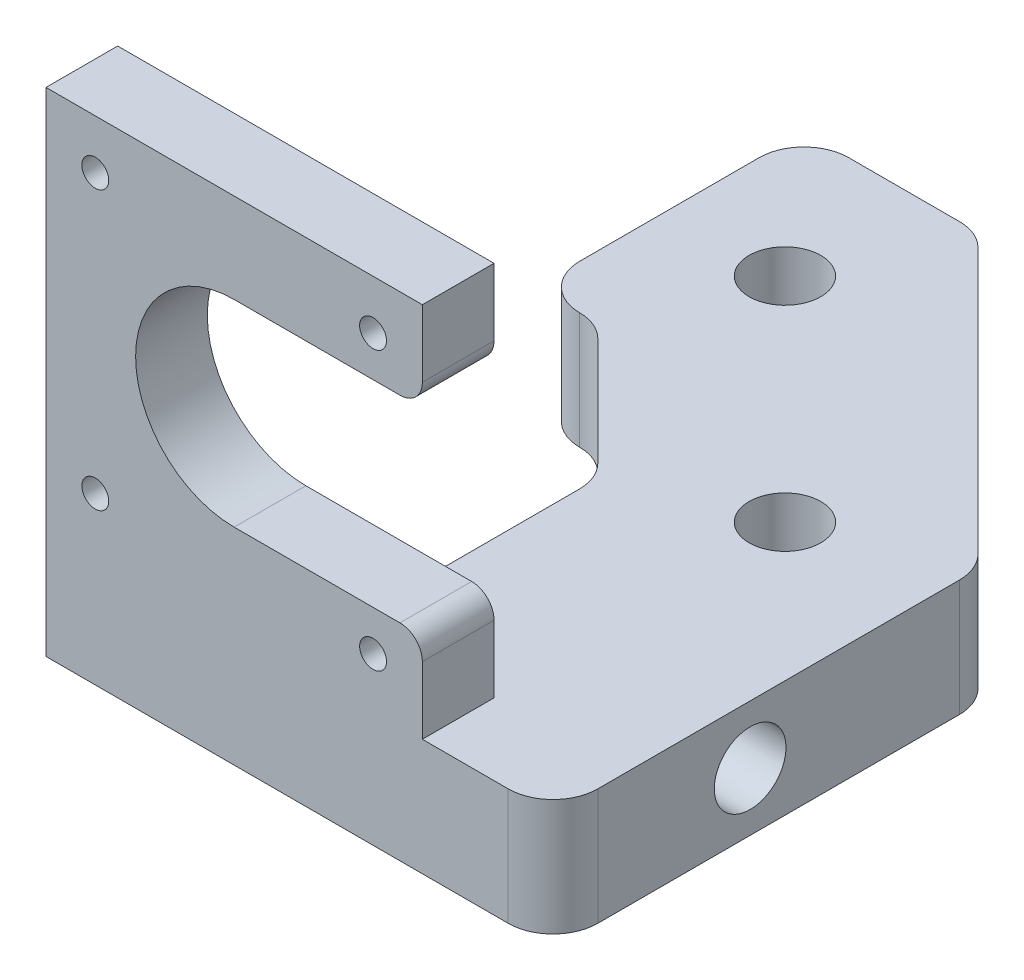
ISO-10303-21;
HEADER;
FILE_DESCRIPTION(('STEP AP214'),'2;1');
FILE_NAME('part.step','',(''),(''),'','','');
FILE_SCHEMA(('AUTOMOTIVE_DESIGN { 1 0 10303 214 1 1 1 1 }'));
ENDSEC;
DATA;
#1=APPLICATION_CONTEXT('core data for automotive mechanical design processes');
#2=APPLICATION_PROTOCOL_DEFINITION('international standard','automotive_design',2000,#1);
#3=PRODUCT_CONTEXT('',#1,'mechanical');
#4=PRODUCT('Part','Part','',(#3));
#5=PRODUCT_RELATED_PRODUCT_CATEGORY('part','',(#4));
#6=PRODUCT_DEFINITION_FORMATION('','',#4);
#7=PRODUCT_DEFINITION_CONTEXT('part definition',#1,'design');
#8=PRODUCT_DEFINITION('design','',#6,#7);
#9=PRODUCT_DEFINITION_SHAPE('','',#8);
#10=(LENGTH_UNIT() NAMED_UNIT(*) SI_UNIT(.MILLI.,.METRE.));
#11=(NAMED_UNIT(*) PLANE_ANGLE_UNIT() SI_UNIT($,.RADIAN.));
#12=(NAMED_UNIT(*) SI_UNIT($,.STERADIAN.) SOLID_ANGLE_UNIT());
#13=UNCERTAINTY_MEASURE_WITH_UNIT(LENGTH_MEASURE(1.E-05),#10,'distance_accuracy_value','');
#14=(GEOMETRIC_REPRESENTATION_CONTEXT(3) GLOBAL_UNCERTAINTY_ASSIGNED_CONTEXT((#13)) GLOBAL_UNIT_ASSIGNED_CONTEXT((#10,
#11,#12)) REPRESENTATION_CONTEXT('',''));
#15=CARTESIAN_POINT('',(0.,0.,0.));
#16=DIRECTION('',(0.,0.,1.));
#17=DIRECTION('',(1.,0.,0.));
#18=AXIS2_PLACEMENT_3D('',#15,#16,#17);
#19=CARTESIAN_POINT('',(15.75,55.,42.0000000000036));
#20=DIRECTION('',(-1.,0.,0.));
#21=DIRECTION('',(0.,0.,1.));
#22=AXIS2_PLACEMENT_3D('',#19,#20,#21);
#23=PLANE('',#22);
#24=DIRECTION('',(0.,-1.,0.));
#25=VECTOR('',#24,1.);
#26=CARTESIAN_POINT('',(15.75,55.,42.0000000000036));
#27=LINE('',#26,#25);
#28=CARTESIAN_POINT('',(15.75,20.5,42.0000000000036));
#29=VERTEX_POINT('',#28);
#30=CARTESIAN_POINT('',(15.75,13.,42.0000000000036));
#31=VERTEX_POINT('',#30);
#32=EDGE_CURVE('E256',#29,#31,#27,.T.);
#33=ORIENTED_EDGE('',*,*,#32,.F.);
#34=DIRECTION('',(0.,0.,-1.));
#35=VECTOR('',#34,1.);
#36=CARTESIAN_POINT('',(15.75,20.5,42.0000000000036));
#37=LINE('',#36,#35);
#38=CARTESIAN_POINT('',(15.75,20.5,50.0000000000032));
#39=VERTEX_POINT('',#38);
#40=EDGE_CURVE('E289',#29,#39,#37,.F.);
#41=ORIENTED_EDGE('',*,*,#40,.T.);
#42=DIRECTION('',(0.,-1.,0.));
#43=VECTOR('',#42,1.);
#44=CARTESIAN_POINT('',(15.75,55.,50.0000000000032));
#45=LINE('',#44,#43);
#46=CARTESIAN_POINT('',(15.75,13.,50.0000000000032));
#47=VERTEX_POINT('',#46);
#48=EDGE_CURVE('E260',#39,#47,#45,.T.);
#49=ORIENTED_EDGE('',*,*,#48,.T.);
#50=DIRECTION('',(0.,0.,-1.));
#51=VECTOR('',#50,1.);
#52=CARTESIAN_POINT('',(15.75,13.,42.0000000000036));
#53=LINE('',#52,#51);
#54=EDGE_CURVE('E244',#47,#31,#53,.T.);
#55=ORIENTED_EDGE('',*,*,#54,.T.);
#56=EDGE_LOOP('',(#33,#41,#49,#55));
#57=FACE_BOUND('',#56,.T.);
#58=ADVANCED_FACE('F31',(#57),#23,.F.);
#59=CARTESIAN_POINT('',(-21.6688483677535,13.,0.));
#60=DIRECTION('',(0.,-1.,0.));
#61=DIRECTION('',(0.,0.,-1.));
#62=AXIS2_PLACEMENT_3D('',#59,#60,#61);
#63=PLANE('',#62);
#64=CARTESIAN_POINT('',(14.9999999999997,13.,8.7867965644033));
#65=DIRECTION('',(0.,1.,0.));
#66=DIRECTION('',(0.,0.,1.));
#67=AXIS2_PLACEMENT_3D('',#64,#65,#66);
#68=CIRCLE('',#67,4.);
#69=CARTESIAN_POINT('',(14.9999999999997,13.,12.7867965644033));
#70=VERTEX_POINT('',#69);
#71=EDGE_CURVE('E460',#70,#70,#68,.T.);
#72=ORIENTED_EDGE('',*,*,#71,.F.);
#73=EDGE_LOOP('',(#72));
#74=FACE_BOUND('',#73,.T.);
#75=CARTESIAN_POINT('',(-8.78679656440375,13.,-15.0000000000002));
#76=DIRECTION('',(0.,1.,0.));
#77=DIRECTION('',(0.,0.,1.));
#78=AXIS2_PLACEMENT_3D('',#75,#76,#77);
#79=CIRCLE('',#78,4.);
#80=CARTESIAN_POINT('',(-8.78679656440375,13.,-11.0000000000002));
#81=VERTEX_POINT('',#80);
#82=EDGE_CURVE('E452',#81,#81,#79,.T.);
#83=ORIENTED_EDGE('',*,*,#82,.F.);
#84=EDGE_LOOP('',(#83));
#85=FACE_BOUND('',#84,.T.);
#86=DIRECTION('',(-1.,0.,0.));
#87=VECTOR('',#86,1.);
#88=CARTESIAN_POINT('',(-26.2500000000003,13.,42.0000000000036));
#89=LINE('',#88,#87);
#90=CARTESIAN_POINT('',(0.331151632246484,13.,42.0000000000036));
#91=VERTEX_POINT('',#90);
#92=EDGE_CURVE('E249',#31,#91,#89,.T.);
#93=ORIENTED_EDGE('',*,*,#92,.F.);
#94=ORIENTED_EDGE('',*,*,#54,.F.);
#95=DIRECTION('',(1.,0.,0.));
#96=VECTOR('',#95,1.);
#97=CARTESIAN_POINT('',(-26.2500000000003,13.,50.0000000000032));
#98=LINE('',#97,#96);
#99=CARTESIAN_POINT('',(25.3311516322459,13.,50.0000000000032));
#100=VERTEX_POINT('',#99);
#101=EDGE_CURVE('E269',#47,#100,#98,.T.);
#102=ORIENTED_EDGE('',*,*,#101,.T.);
#103=CARTESIAN_POINT('',(25.3311516322459,13.,45.0000000000032));
#104=DIRECTION('',(0.,-1.,0.));
#105=DIRECTION('',(0.,0.,-1.));
#106=AXIS2_PLACEMENT_3D('',#103,#104,#105);
#107=CIRCLE('',#106,5.);
#108=CARTESIAN_POINT('',(30.3311516322459,13.,45.0000000000032));
#109=VERTEX_POINT('',#108);
#110=EDGE_CURVE('E347',#100,#109,#107,.F.);
#111=ORIENTED_EDGE('',*,*,#110,.T.);
#112=DIRECTION('',(0.,0.,-1.));
#113=VECTOR('',#112,1.);
#114=CARTESIAN_POINT('',(30.3311516322459,13.,2.57359312880659));
#115=LINE('',#114,#113);
#116=CARTESIAN_POINT('',(30.3311516322459,13.,4.64466094067207));
#117=VERTEX_POINT('',#116);
#118=EDGE_CURVE('E444',#109,#117,#115,.T.);
#119=ORIENTED_EDGE('',*,*,#118,.T.);
#120=CARTESIAN_POINT('',(25.3311516322459,13.,4.64466094067207));
#121=DIRECTION('',(0.,-1.,0.));
#122=DIRECTION('',(0.,0.,-1.));
#123=AXIS2_PLACEMENT_3D('',#120,#121,#122);
#124=CIRCLE('',#123,5.);
#125=CARTESIAN_POINT('',(28.8666855381787,13.,1.10912703473934));
#126=VERTEX_POINT('',#125);
#127=EDGE_CURVE('E345',#117,#126,#124,.F.);
#128=ORIENTED_EDGE('',*,*,#127,.T.);
#129=DIRECTION('',(-0.707106781186548,0.,-0.707106781186548));
#130=VECTOR('',#129,1.);
#131=CARTESIAN_POINT('',(-2.24244149656067,13.,-30.));
#132=LINE('',#131,#130);
#133=CARTESIAN_POINT('',(-0.777975402493406,13.,-28.5355339059327));
#134=VERTEX_POINT('',#133);
#135=EDGE_CURVE('E447',#126,#134,#132,.T.);
#136=ORIENTED_EDGE('',*,*,#135,.T.);
#137=CARTESIAN_POINT('',(-4.31350930842614,13.,-25.));
#138=DIRECTION('',(0.,-1.,0.));
#139=DIRECTION('',(0.,0.,-1.));
#140=AXIS2_PLACEMENT_3D('',#137,#138,#139);
#141=CIRCLE('',#140,5.);
#142=CARTESIAN_POINT('',(-4.31350930842614,13.,-30.));
#143=VERTEX_POINT('',#142);
#144=EDGE_CURVE('E343',#134,#143,#141,.F.);
#145=ORIENTED_EDGE('',*,*,#144,.T.);
#146=DIRECTION('',(-1.,0.,0.));
#147=VECTOR('',#146,1.);
#148=CARTESIAN_POINT('',(-21.6688483677535,13.,-30.));
#149=LINE('',#148,#147);
#150=CARTESIAN_POINT('',(-16.6688483677535,13.,-30.));
#151=VERTEX_POINT('',#150);
#152=EDGE_CURVE('E323',#143,#151,#149,.T.);
#153=ORIENTED_EDGE('',*,*,#152,.T.);
#154=CARTESIAN_POINT('',(-16.6688483677535,13.,-25.));
#155=DIRECTION('',(0.,-1.,0.));
#156=DIRECTION('',(0.,0.,-1.));
#157=AXIS2_PLACEMENT_3D('',#154,#155,#156);
#158=CIRCLE('',#157,5.);
#159=CARTESIAN_POINT('',(-21.6688483677535,13.,-25.));
#160=VERTEX_POINT('',#159);
#161=EDGE_CURVE('E387',#151,#160,#158,.F.);
#162=ORIENTED_EDGE('',*,*,#161,.T.);
#163=DIRECTION('',(0.,0.,1.));
#164=VECTOR('',#163,1.);
#165=CARTESIAN_POINT('',(-21.6688483677535,13.,0.));
#166=LINE('',#165,#164);
#167=CARTESIAN_POINT('',(-21.6688483677535,13.,-4.99974746511714));
#168=VERTEX_POINT('',#167);
#169=EDGE_CURVE('E318',#160,#168,#166,.T.);
#170=ORIENTED_EDGE('',*,*,#169,.T.);
#171=CARTESIAN_POINT('',(-16.6688483677535,13.,-4.99974746511714));
#172=DIRECTION('',(0.,-1.,0.));
#173=DIRECTION('',(0.,0.,-1.));
#174=AXIS2_PLACEMENT_3D('',#171,#172,#173);
#175=CIRCLE('',#174,5.);
#176=CARTESIAN_POINT('',(-16.7043822736864,13.,0.000126267441430579));
#177=VERTEX_POINT('',#176);
#178=EDGE_CURVE('E385',#168,#177,#175,.F.);
#179=ORIENTED_EDGE('',*,*,#178,.T.);
#180=CARTESIAN_POINT('',(-16.7399161796193,13.,5.));
#181=DIRECTION('',(0.,-1.,0.));
#182=DIRECTION('',(0.,0.,-1.));
#183=AXIS2_PLACEMENT_3D('',#180,#181,#182);
#184=CIRCLE('',#183,5.);
#185=CARTESIAN_POINT('',(-13.2043822736866,13.,1.46446609406726));
#186=VERTEX_POINT('',#185);
#187=EDGE_CURVE('E372',#177,#186,#184,.T.);
#188=ORIENTED_EDGE('',*,*,#187,.T.);
#189=DIRECTION('',(0.707106781186548,0.,0.707106781186547));
#190=VECTOR('',#189,1.);
#191=CARTESIAN_POINT('',(0.331151632246484,13.,15.0000000000003));
#192=LINE('',#191,#190);
#193=CARTESIAN_POINT('',(-1.13331446182078,13.,13.5355339059331));
#194=VERTEX_POINT('',#193);
#195=EDGE_CURVE('E431',#186,#194,#192,.T.);
#196=ORIENTED_EDGE('',*,*,#195,.T.);
#197=CARTESIAN_POINT('',(-4.66884836775352,13.,17.0710678118658));
#198=DIRECTION('',(0.,-1.,0.));
#199=DIRECTION('',(0.,0.,-1.));
#200=AXIS2_PLACEMENT_3D('',#197,#198,#199);
#201=CIRCLE('',#200,5.);
#202=CARTESIAN_POINT('',(0.331151632246484,13.,17.0710678118658));
#203=VERTEX_POINT('',#202);
#204=EDGE_CURVE('E367',#194,#203,#201,.T.);
#205=ORIENTED_EDGE('',*,*,#204,.T.);
#206=DIRECTION('',(0.,0.,1.));
#207=VECTOR('',#206,1.);
#208=CARTESIAN_POINT('',(0.331151632246484,13.,42.0000000000036));
#209=LINE('',#208,#207);
#210=EDGE_CURVE('E281',#203,#91,#209,.T.);
#211=ORIENTED_EDGE('',*,*,#210,.T.);
#212=EDGE_LOOP('',(#93,#94,#102,#111,#119,#128,#136,#145,#153,#162,#170,#179,#188,#196,#205,#211));
#213=FACE_BOUND('',#212,.T.);
#214=ADVANCED_FACE('F490',(#74,#85,#213),#63,.F.);
#215=CARTESIAN_POINT('',(-21.6688483677535,0.,0.));
#216=DIRECTION('',(0.,-1.,0.));
#217=DIRECTION('',(0.,0.,-1.));
#218=AXIS2_PLACEMENT_3D('',#215,#216,#217);
#219=PLANE('',#218);
#220=CARTESIAN_POINT('',(-8.78679656440375,0.,-15.0000000000002));
#221=DIRECTION('',(0.,1.,0.));
#222=DIRECTION('',(0.,0.,1.));
#223=AXIS2_PLACEMENT_3D('',#220,#221,#222);
#224=CIRCLE('',#223,4.);
#225=CARTESIAN_POINT('',(-8.78679656440375,0.,-11.0000000000002));
#226=VERTEX_POINT('',#225);
#227=EDGE_CURVE('E440',#226,#226,#224,.T.);
#228=ORIENTED_EDGE('',*,*,#227,.T.);
#229=EDGE_LOOP('',(#228));
#230=FACE_BOUND('',#229,.T.);
#231=DIRECTION('',(0.,0.,1.));
#232=VECTOR('',#231,1.);
#233=CARTESIAN_POINT('',(-21.6688483677535,0.,0.));
#234=LINE('',#233,#232);
#235=CARTESIAN_POINT('',(-21.6688483677535,0.,-25.));
#236=VERTEX_POINT('',#235);
#237=CARTESIAN_POINT('',(-21.6688483677535,0.,-4.99974746511714));
#238=VERTEX_POINT('',#237);
#239=EDGE_CURVE('E326',#236,#238,#234,.T.);
#240=ORIENTED_EDGE('',*,*,#239,.F.);
#241=CARTESIAN_POINT('',(-16.6688483677535,0.,-25.));
#242=DIRECTION('',(0.,-1.,0.));
#243=DIRECTION('',(0.,0.,-1.));
#244=AXIS2_PLACEMENT_3D('',#241,#242,#243);
#245=CIRCLE('',#244,5.);
#246=CARTESIAN_POINT('',(-16.6688483677535,0.,-30.));
#247=VERTEX_POINT('',#246);
#248=EDGE_CURVE('E381',#236,#247,#245,.T.);
#249=ORIENTED_EDGE('',*,*,#248,.T.);
#250=DIRECTION('',(-1.,0.,0.));
#251=VECTOR('',#250,1.);
#252=CARTESIAN_POINT('',(-21.6688483677535,0.,-30.));
#253=LINE('',#252,#251);
#254=CARTESIAN_POINT('',(-4.31350930842614,0.,-30.));
#255=VERTEX_POINT('',#254);
#256=EDGE_CURVE('E425',#255,#247,#253,.T.);
#257=ORIENTED_EDGE('',*,*,#256,.F.);
#258=CARTESIAN_POINT('',(-4.31350930842614,0.,-25.));
#259=DIRECTION('',(0.,-1.,0.));
#260=DIRECTION('',(0.,0.,-1.));
#261=AXIS2_PLACEMENT_3D('',#258,#259,#260);
#262=CIRCLE('',#261,5.);
#263=CARTESIAN_POINT('',(-0.777975402493406,0.,-28.5355339059327));
#264=VERTEX_POINT('',#263);
#265=EDGE_CURVE('E334',#255,#264,#262,.T.);
#266=ORIENTED_EDGE('',*,*,#265,.T.);
#267=DIRECTION('',(-0.707106781186548,0.,-0.707106781186548));
#268=VECTOR('',#267,1.);
#269=CARTESIAN_POINT('',(-2.24244149656067,0.,-30.));
#270=LINE('',#269,#268);
#271=CARTESIAN_POINT('',(28.8666855381787,0.,1.10912703473934));
#272=VERTEX_POINT('',#271);
#273=EDGE_CURVE('E423',#272,#264,#270,.T.);
#274=ORIENTED_EDGE('',*,*,#273,.F.);
#275=CARTESIAN_POINT('',(25.3311516322459,0.,4.64466094067207));
#276=DIRECTION('',(0.,-1.,0.));
#277=DIRECTION('',(0.,0.,-1.));
#278=AXIS2_PLACEMENT_3D('',#275,#276,#277);
#279=CIRCLE('',#278,5.);
#280=CARTESIAN_POINT('',(30.3311516322459,0.,4.64466094067207));
#281=VERTEX_POINT('',#280);
#282=EDGE_CURVE('E336',#272,#281,#279,.T.);
#283=ORIENTED_EDGE('',*,*,#282,.T.);
#284=DIRECTION('',(0.,0.,-1.));
#285=VECTOR('',#284,1.);
#286=CARTESIAN_POINT('',(30.3311516322459,0.,2.57359312880659));
#287=LINE('',#286,#285);
#288=CARTESIAN_POINT('',(30.3311516322459,0.,45.0000000000032));
#289=VERTEX_POINT('',#288);
#290=EDGE_CURVE('E420',#289,#281,#287,.T.);
#291=ORIENTED_EDGE('',*,*,#290,.F.);
#292=CARTESIAN_POINT('',(25.3311516322459,0.,45.0000000000032));
#293=DIRECTION('',(0.,-1.,0.));
#294=DIRECTION('',(0.,0.,-1.));
#295=AXIS2_PLACEMENT_3D('',#292,#293,#294);
#296=CIRCLE('',#295,5.);
#297=CARTESIAN_POINT('',(25.3311516322459,0.,50.0000000000032));
#298=VERTEX_POINT('',#297);
#299=EDGE_CURVE('E338',#289,#298,#296,.T.);
#300=ORIENTED_EDGE('',*,*,#299,.T.);
#301=DIRECTION('',(1.,0.,0.));
#302=VECTOR('',#301,1.);
#303=CARTESIAN_POINT('',(-26.2500000000003,0.,50.0000000000032));
#304=LINE('',#303,#302);
#305=CARTESIAN_POINT('',(-26.2500000000003,0.,50.0000000000032));
#306=VERTEX_POINT('',#305);
#307=EDGE_CURVE('E413',#306,#298,#304,.T.);
#308=ORIENTED_EDGE('',*,*,#307,.F.);
#309=DIRECTION('',(0.,0.,1.));
#310=VECTOR('',#309,1.);
#311=CARTESIAN_POINT('',(-26.2500000000003,0.,50.0000000000032));
#312=LINE('',#311,#310);
#313=CARTESIAN_POINT('',(-26.2500000000003,0.,42.0000000000036));
#314=VERTEX_POINT('',#313);
#315=EDGE_CURVE('E315',#314,#306,#312,.T.);
#316=ORIENTED_EDGE('',*,*,#315,.F.);
#317=DIRECTION('',(-1.,0.,0.));
#318=VECTOR('',#317,1.);
#319=CARTESIAN_POINT('',(-26.2500000000003,0.,42.0000000000036));
#320=LINE('',#319,#318);
#321=CARTESIAN_POINT('',(0.331151632246484,0.,42.0000000000036));
#322=VERTEX_POINT('',#321);
#323=EDGE_CURVE('E402',#322,#314,#320,.T.);
#324=ORIENTED_EDGE('',*,*,#323,.F.);
#325=DIRECTION('',(0.,0.,1.));
#326=VECTOR('',#325,1.);
#327=CARTESIAN_POINT('',(0.331151632246484,0.,42.0000000000036));
#328=LINE('',#327,#326);
#329=CARTESIAN_POINT('',(0.331151632246484,0.,17.0710678118658));
#330=VERTEX_POINT('',#329);
#331=EDGE_CURVE('E411',#330,#322,#328,.T.);
#332=ORIENTED_EDGE('',*,*,#331,.F.);
#333=CARTESIAN_POINT('',(-4.66884836775352,0.,17.0710678118658));
#334=DIRECTION('',(0.,-1.,0.));
#335=DIRECTION('',(0.,0.,-1.));
#336=AXIS2_PLACEMENT_3D('',#333,#334,#335);
#337=CIRCLE('',#336,5.);
#338=CARTESIAN_POINT('',(-1.13331446182078,0.,13.5355339059331));
#339=VERTEX_POINT('',#338);
#340=EDGE_CURVE('E365',#330,#339,#337,.F.);
#341=ORIENTED_EDGE('',*,*,#340,.T.);
#342=DIRECTION('',(0.707106781186548,0.,0.707106781186547));
#343=VECTOR('',#342,1.);
#344=CARTESIAN_POINT('',(0.331151632246484,0.,15.0000000000003));
#345=LINE('',#344,#343);
#346=CARTESIAN_POINT('',(-13.2043822736866,0.,1.46446609406726));
#347=VERTEX_POINT('',#346);
#348=EDGE_CURVE('E415',#347,#339,#345,.T.);
#349=ORIENTED_EDGE('',*,*,#348,.F.);
#350=CARTESIAN_POINT('',(-16.7399161796193,0.,5.));
#351=DIRECTION('',(0.,-1.,0.));
#352=DIRECTION('',(0.,0.,-1.));
#353=AXIS2_PLACEMENT_3D('',#350,#351,#352);
#354=CIRCLE('',#353,5.);
#355=CARTESIAN_POINT('',(-16.7043822736864,0.,0.000126267441430579));
#356=VERTEX_POINT('',#355);
#357=EDGE_CURVE('E369',#347,#356,#354,.F.);
#358=ORIENTED_EDGE('',*,*,#357,.T.);
#359=CARTESIAN_POINT('',(-16.6688483677535,0.,-4.99974746511714));
#360=DIRECTION('',(0.,-1.,0.));
#361=DIRECTION('',(0.,0.,-1.));
#362=AXIS2_PLACEMENT_3D('',#359,#360,#361);
#363=CIRCLE('',#362,5.);
#364=EDGE_CURVE('E379',#356,#238,#363,.T.);
#365=ORIENTED_EDGE('',*,*,#364,.T.);
#366=EDGE_LOOP('',(#240,#249,#257,#266,#274,#283,#291,#300,#308,#316,#324,#332,#341,#349,#358,#365));
#367=FACE_BOUND('',#366,.T.);
#368=CARTESIAN_POINT('',(14.9999999999997,0.,8.7867965644033));
#369=DIRECTION('',(0.,1.,0.));
#370=DIRECTION('',(0.,0.,1.));
#371=AXIS2_PLACEMENT_3D('',#368,#369,#370);
#372=CIRCLE('',#371,4.);
#373=CARTESIAN_POINT('',(14.9999999999997,0.,12.7867965644033));
#374=VERTEX_POINT('',#373);
#375=EDGE_CURVE('E462',#374,#374,#372,.T.);
#376=ORIENTED_EDGE('',*,*,#375,.T.);
#377=EDGE_LOOP('',(#376));
#378=FACE_BOUND('',#377,.T.);
#379=ADVANCED_FACE('F409',(#230,#367,#378),#219,.T.);
#380=CARTESIAN_POINT('',(0.331151632246484,13.,15.0000000000003));
#381=DIRECTION('',(0.707106781186547,0.,-0.707106781186548));
#382=DIRECTION('',(-0.707106781186548,0.,-0.707106781186547));
#383=AXIS2_PLACEMENT_3D('',#380,#381,#382);
#384=PLANE('',#383);
#385=ORIENTED_EDGE('',*,*,#348,.T.);
#386=DIRECTION('',(0.,-1.,0.));
#387=VECTOR('',#386,1.);
#388=CARTESIAN_POINT('',(-1.13331446182078,13.,13.5355339059331));
#389=LINE('',#388,#387);
#390=EDGE_CURVE('E360',#339,#194,#389,.F.);
#391=ORIENTED_EDGE('',*,*,#390,.T.);
#392=ORIENTED_EDGE('',*,*,#195,.F.);
#393=DIRECTION('',(0.,-1.,0.));
#394=VECTOR('',#393,1.);
#395=CARTESIAN_POINT('',(-13.2043822736866,0.,1.46446609406726));
#396=LINE('',#395,#394);
#397=EDGE_CURVE('E357',#186,#347,#396,.T.);
#398=ORIENTED_EDGE('',*,*,#397,.T.);
#399=EDGE_LOOP('',(#385,#391,#392,#398));
#400=FACE_BOUND('',#399,.T.);
#401=ADVANCED_FACE('F556',(#400),#384,.F.);
#402=CARTESIAN_POINT('',(0.331151632246484,13.,42.0000000000036));
#403=DIRECTION('',(1.,0.,0.));
#404=DIRECTION('',(0.,0.,-1.));
#405=AXIS2_PLACEMENT_3D('',#402,#403,#404);
#406=PLANE('',#405);
#407=CARTESIAN_POINT('',(0.331151632246488,6.5,28.0000000000001));
#408=DIRECTION('',(-1.,0.,0.));
#409=DIRECTION('',(0.,0.,1.));
#410=AXIS2_PLACEMENT_3D('',#407,#408,#409);
#411=CIRCLE('',#410,4.);
#412=CARTESIAN_POINT('',(0.331151632246488,6.5,32.0000000000001));
#413=VERTEX_POINT('',#412);
#414=EDGE_CURVE('E278',#413,#413,#411,.T.);
#415=ORIENTED_EDGE('',*,*,#414,.F.);
#416=EDGE_LOOP('',(#415));
#417=FACE_BOUND('',#416,.T.);
#418=ORIENTED_EDGE('',*,*,#210,.F.);
#419=DIRECTION('',(0.,-1.,0.));
#420=VECTOR('',#419,1.);
#421=CARTESIAN_POINT('',(0.331151632246484,0.,17.0710678118658));
#422=LINE('',#421,#420);
#423=EDGE_CURVE('E354',#203,#330,#422,.T.);
#424=ORIENTED_EDGE('',*,*,#423,.T.);
#425=ORIENTED_EDGE('',*,*,#331,.T.);
#426=DIRECTION('',(0.,-1.,0.));
#427=VECTOR('',#426,1.);
#428=CARTESIAN_POINT('',(0.331151632246484,13.,42.0000000000036));
#429=LINE('',#428,#427);
#430=EDGE_CURVE('E320',#91,#322,#429,.T.);
#431=ORIENTED_EDGE('',*,*,#430,.F.);
#432=EDGE_LOOP('',(#418,#424,#425,#431));
#433=FACE_BOUND('',#432,.T.);
#434=ADVANCED_FACE('F559',(#417,#433),#406,.F.);
#435=CARTESIAN_POINT('',(-26.2500000000003,13.,42.0000000000036));
#436=DIRECTION('',(0.,0.,1.));
#437=DIRECTION('',(1.,0.,0.));
#438=AXIS2_PLACEMENT_3D('',#435,#436,#437);
#439=PLANE('',#438);
#440=CARTESIAN_POINT('',(10.2499999999998,18.5000000000001,42.0000000000036));
#441=DIRECTION('',(0.,0.,1.));
#442=DIRECTION('',(1.,0.,0.));
#443=AXIS2_PLACEMENT_3D('',#440,#441,#442);
#444=CIRCLE('',#443,1.5);
#445=CARTESIAN_POINT('',(11.7499999999998,18.5000000000001,42.0000000000036));
#446=VERTEX_POINT('',#445);
#447=EDGE_CURVE('E218',#446,#446,#444,.F.);
#448=ORIENTED_EDGE('',*,*,#447,.F.);
#449=EDGE_LOOP('',(#448));
#450=FACE_BOUND('',#449,.T.);
#451=CARTESIAN_POINT('',(-20.7500000000003,18.5000000000001,42.0000000000036));
#452=DIRECTION('',(0.,0.,1.));
#453=DIRECTION('',(1.,0.,0.));
#454=AXIS2_PLACEMENT_3D('',#451,#452,#453);
#455=CIRCLE('',#454,1.5);
#456=CARTESIAN_POINT('',(-19.2500000000003,18.5000000000001,42.0000000000036));
#457=VERTEX_POINT('',#456);
#458=EDGE_CURVE('E229',#457,#457,#455,.F.);
#459=ORIENTED_EDGE('',*,*,#458,.F.);
#460=EDGE_LOOP('',(#459));
#461=FACE_BOUND('',#460,.T.);
#462=CARTESIAN_POINT('',(-20.7500000000003,49.5,42.0000000000036));
#463=DIRECTION('',(0.,0.,1.));
#464=DIRECTION('',(1.,0.,0.));
#465=AXIS2_PLACEMENT_3D('',#462,#463,#464);
#466=CIRCLE('',#465,1.5);
#467=CARTESIAN_POINT('',(-19.2500000000002,49.5,42.0000000000036));
#468=VERTEX_POINT('',#467);
#469=EDGE_CURVE('E235',#468,#468,#466,.F.);
#470=ORIENTED_EDGE('',*,*,#469,.F.);
#471=EDGE_LOOP('',(#470));
#472=FACE_BOUND('',#471,.T.);
#473=CARTESIAN_POINT('',(10.2499999999998,49.5,42.0000000000036));
#474=DIRECTION('',(0.,0.,1.));
#475=DIRECTION('',(1.,0.,0.));
#476=AXIS2_PLACEMENT_3D('',#473,#474,#475);
#477=CIRCLE('',#476,1.5);
#478=CARTESIAN_POINT('',(11.7499999999998,49.5,42.0000000000036));
#479=VERTEX_POINT('',#478);
#480=EDGE_CURVE('E241',#479,#479,#477,.F.);
#481=ORIENTED_EDGE('',*,*,#480,.F.);
#482=EDGE_LOOP('',(#481));
#483=FACE_BOUND('',#482,.T.);
#484=DIRECTION('',(-1.,0.,0.));
#485=VECTOR('',#484,1.);
#486=CARTESIAN_POINT('',(-5.25000000000015,23.,42.0000000000036));
#487=LINE('',#486,#485);
#488=CARTESIAN_POINT('',(13.25,23.,42.0000000000036));
#489=VERTEX_POINT('',#488);
#490=CARTESIAN_POINT('',(-5.25000000000015,23.,42.0000000000036));
#491=VERTEX_POINT('',#490);
#492=EDGE_CURVE('E199',#489,#491,#487,.T.);
#493=ORIENTED_EDGE('',*,*,#492,.F.);
#494=CARTESIAN_POINT('',(13.25,20.5,42.0000000000036));
#495=DIRECTION('',(0.,0.,1.));
#496=DIRECTION('',(1.,0.,0.));
#497=AXIS2_PLACEMENT_3D('',#494,#495,#496);
#498=CIRCLE('',#497,2.5);
#499=EDGE_CURVE('E287',#489,#29,#498,.F.);
#500=ORIENTED_EDGE('',*,*,#499,.T.);
#501=ORIENTED_EDGE('',*,*,#32,.T.);
#502=ORIENTED_EDGE('',*,*,#92,.T.);
#503=ORIENTED_EDGE('',*,*,#430,.T.);
#504=ORIENTED_EDGE('',*,*,#323,.T.);
#505=DIRECTION('',(0.,-1.,0.));
#506=VECTOR('',#505,1.);
#507=CARTESIAN_POINT('',(-26.2500000000003,13.,42.0000000000036));
#508=LINE('',#507,#506);
#509=CARTESIAN_POINT('',(-26.2500000000003,55.,42.0000000000036));
#510=VERTEX_POINT('',#509);
#511=EDGE_CURVE('E305',#510,#314,#508,.T.);
#512=ORIENTED_EDGE('',*,*,#511,.F.);
#513=DIRECTION('',(-1.,0.,0.));
#514=VECTOR('',#513,1.);
#515=CARTESIAN_POINT('',(-26.2500000000003,55.,42.0000000000036));
#516=LINE('',#515,#514);
#517=CARTESIAN_POINT('',(15.75,55.,42.0000000000036));
#518=VERTEX_POINT('',#517);
#519=EDGE_CURVE('E253',#518,#510,#516,.T.);
#520=ORIENTED_EDGE('',*,*,#519,.F.);
#521=CARTESIAN_POINT('',(15.75,47.5,42.0000000000036));
#522=VERTEX_POINT('',#521);
#523=EDGE_CURVE('E257',#518,#522,#27,.T.);
#524=ORIENTED_EDGE('',*,*,#523,.T.);
#525=CARTESIAN_POINT('',(13.25,47.5,42.0000000000036));
#526=DIRECTION('',(0.,0.,1.));
#527=DIRECTION('',(1.,0.,0.));
#528=AXIS2_PLACEMENT_3D('',#525,#526,#527);
#529=CIRCLE('',#528,2.5);
#530=CARTESIAN_POINT('',(13.25,45.,42.0000000000036));
#531=VERTEX_POINT('',#530);
#532=EDGE_CURVE('E303',#522,#531,#529,.F.);
#533=ORIENTED_EDGE('',*,*,#532,.T.);
#534=DIRECTION('',(1.,0.,0.));
#535=VECTOR('',#534,1.);
#536=CARTESIAN_POINT('',(-5.25000000000015,45.,42.0000000000036));
#537=LINE('',#536,#535);
#538=CARTESIAN_POINT('',(-5.25000000000015,45.,42.0000000000036));
#539=VERTEX_POINT('',#538);
#540=EDGE_CURVE('E213',#539,#531,#537,.T.);
#541=ORIENTED_EDGE('',*,*,#540,.F.);
#542=CARTESIAN_POINT('',(-5.25000000000015,34.,42.0000000000036));
#543=DIRECTION('',(0.,0.,1.));
#544=DIRECTION('',(1.,0.,0.));
#545=AXIS2_PLACEMENT_3D('',#542,#543,#544);
#546=CIRCLE('',#545,11.);
#547=EDGE_CURVE('E217',#491,#539,#546,.F.);
#548=ORIENTED_EDGE('',*,*,#547,.F.);
#549=EDGE_LOOP('',(#493,#500,#501,#502,#503,#504,#512,#520,#524,#533,#541,#548));
#550=FACE_BOUND('',#549,.T.);
#551=ADVANCED_FACE('F301',(#450,#461,#472,#483,#550),#439,.F.);
#552=CARTESIAN_POINT('',(-26.2500000000003,13.,50.0000000000032));
#553=DIRECTION('',(1.,0.,0.));
#554=DIRECTION('',(0.,0.,-1.));
#555=AXIS2_PLACEMENT_3D('',#552,#553,#554);
#556=PLANE('',#555);
#557=ORIENTED_EDGE('',*,*,#315,.T.);
#558=DIRECTION('',(0.,-1.,0.));
#559=VECTOR('',#558,1.);
#560=CARTESIAN_POINT('',(-26.2500000000003,13.,50.0000000000032));
#561=LINE('',#560,#559);
#562=CARTESIAN_POINT('',(-26.2500000000003,55.,50.0000000000032));
#563=VERTEX_POINT('',#562);
#564=EDGE_CURVE('E313',#563,#306,#561,.T.);
#565=ORIENTED_EDGE('',*,*,#564,.F.);
#566=DIRECTION('',(0.,0.,1.));
#567=VECTOR('',#566,1.);
#568=CARTESIAN_POINT('',(-26.2500000000003,55.,42.0000000000036));
#569=LINE('',#568,#567);
#570=EDGE_CURVE('E245',#510,#563,#569,.T.);
#571=ORIENTED_EDGE('',*,*,#570,.F.);
#572=ORIENTED_EDGE('',*,*,#511,.T.);
#573=EDGE_LOOP('',(#557,#565,#571,#572));
#574=FACE_BOUND('',#573,.T.);
#575=ADVANCED_FACE('F310',(#574),#556,.F.);
#576=CARTESIAN_POINT('',(-26.2500000000003,13.,50.0000000000032));
#577=DIRECTION('',(0.,0.,-1.));
#578=DIRECTION('',(-1.,0.,0.));
#579=AXIS2_PLACEMENT_3D('',#576,#577,#578);
#580=PLANE('',#579);
#581=CARTESIAN_POINT('',(10.2499999999998,18.5000000000001,50.0000000000032));
#582=DIRECTION('',(0.,0.,1.));
#583=DIRECTION('',(1.,0.,0.));
#584=AXIS2_PLACEMENT_3D('',#581,#582,#583);
#585=CIRCLE('',#584,1.5);
#586=CARTESIAN_POINT('',(11.7499999999998,18.5000000000001,50.0000000000032));
#587=VERTEX_POINT('',#586);
#588=EDGE_CURVE('E223',#587,#587,#585,.T.);
#589=ORIENTED_EDGE('',*,*,#588,.F.);
#590=EDGE_LOOP('',(#589));
#591=FACE_BOUND('',#590,.T.);
#592=ORIENTED_EDGE('',*,*,#48,.F.);
#593=CARTESIAN_POINT('',(13.25,20.5,50.0000000000032));
#594=DIRECTION('',(0.,0.,-1.));
#595=DIRECTION('',(-1.,0.,0.));
#596=AXIS2_PLACEMENT_3D('',#593,#594,#595);
#597=CIRCLE('',#596,2.5);
#598=CARTESIAN_POINT('',(13.25,23.,50.0000000000032));
#599=VERTEX_POINT('',#598);
#600=EDGE_CURVE('E212',#39,#599,#597,.F.);
#601=ORIENTED_EDGE('',*,*,#600,.T.);
#602=DIRECTION('',(1.,0.,0.));
#603=VECTOR('',#602,1.);
#604=CARTESIAN_POINT('',(-5.25000000000015,23.,50.0000000000032));
#605=LINE('',#604,#603);
#606=CARTESIAN_POINT('',(-5.25000000000015,23.,50.0000000000032));
#607=VERTEX_POINT('',#606);
#608=EDGE_CURVE('E196',#607,#599,#605,.T.);
#609=ORIENTED_EDGE('',*,*,#608,.F.);
#610=CARTESIAN_POINT('',(-5.25000000000015,34.,50.0000000000032));
#611=DIRECTION('',(0.,0.,1.));
#612=DIRECTION('',(1.,0.,0.));
#613=AXIS2_PLACEMENT_3D('',#610,#611,#612);
#614=CIRCLE('',#613,11.);
#615=CARTESIAN_POINT('',(-5.25000000000015,45.,50.0000000000032));
#616=VERTEX_POINT('',#615);
#617=EDGE_CURVE('E210',#616,#607,#614,.T.);
#618=ORIENTED_EDGE('',*,*,#617,.F.);
#619=DIRECTION('',(-1.,0.,0.));
#620=VECTOR('',#619,1.);
#621=CARTESIAN_POINT('',(-5.25000000000015,45.,50.0000000000032));
#622=LINE('',#621,#620);
#623=CARTESIAN_POINT('',(13.25,45.,50.0000000000032));
#624=VERTEX_POINT('',#623);
#625=EDGE_CURVE('E598',#624,#616,#622,.T.);
#626=ORIENTED_EDGE('',*,*,#625,.F.);
#627=CARTESIAN_POINT('',(13.25,47.5,50.0000000000032));
#628=DIRECTION('',(0.,0.,-1.));
#629=DIRECTION('',(-1.,0.,0.));
#630=AXIS2_PLACEMENT_3D('',#627,#628,#629);
#631=CIRCLE('',#630,2.5);
#632=CARTESIAN_POINT('',(15.75,47.5,50.0000000000032));
#633=VERTEX_POINT('',#632);
#634=EDGE_CURVE('E46',#624,#633,#631,.F.);
#635=ORIENTED_EDGE('',*,*,#634,.T.);
#636=CARTESIAN_POINT('',(15.75,55.,50.0000000000032));
#637=VERTEX_POINT('',#636);
#638=EDGE_CURVE('E276',#637,#633,#45,.T.);
#639=ORIENTED_EDGE('',*,*,#638,.F.);
#640=DIRECTION('',(1.,0.,0.));
#641=VECTOR('',#640,1.);
#642=CARTESIAN_POINT('',(-26.2500000000003,55.,50.0000000000032));
#643=LINE('',#642,#641);
#644=EDGE_CURVE('E248',#563,#637,#643,.T.);
#645=ORIENTED_EDGE('',*,*,#644,.F.);
#646=ORIENTED_EDGE('',*,*,#564,.T.);
#647=ORIENTED_EDGE('',*,*,#307,.T.);
#648=DIRECTION('',(0.,-1.,0.));
#649=VECTOR('',#648,1.);
#650=CARTESIAN_POINT('',(25.3311516322459,13.,50.0000000000032));
#651=LINE('',#650,#649);
#652=EDGE_CURVE('E340',#298,#100,#651,.F.);
#653=ORIENTED_EDGE('',*,*,#652,.T.);
#654=ORIENTED_EDGE('',*,*,#101,.F.);
#655=EDGE_LOOP('',(#592,#601,#609,#618,#626,#635,#639,#645,#646,#647,#653,#654));
#656=FACE_BOUND('',#655,.T.);
#657=CARTESIAN_POINT('',(-20.7500000000003,18.5000000000001,50.0000000000032));
#658=DIRECTION('',(0.,0.,1.));
#659=DIRECTION('',(1.,0.,0.));
#660=AXIS2_PLACEMENT_3D('',#657,#658,#659);
#661=CIRCLE('',#660,1.5);
#662=CARTESIAN_POINT('',(-19.2500000000003,18.5000000000001,50.0000000000032));
#663=VERTEX_POINT('',#662);
#664=EDGE_CURVE('E220',#663,#663,#661,.T.);
#665=ORIENTED_EDGE('',*,*,#664,.F.);
#666=EDGE_LOOP('',(#665));
#667=FACE_BOUND('',#666,.T.);
#668=CARTESIAN_POINT('',(-20.7500000000003,49.5,50.0000000000032));
#669=DIRECTION('',(0.,0.,1.));
#670=DIRECTION('',(1.,0.,0.));
#671=AXIS2_PLACEMENT_3D('',#668,#669,#670);
#672=CIRCLE('',#671,1.5);
#673=CARTESIAN_POINT('',(-19.2500000000002,49.5,50.0000000000032));
#674=VERTEX_POINT('',#673);
#675=EDGE_CURVE('E232',#674,#674,#672,.T.);
#676=ORIENTED_EDGE('',*,*,#675,.F.);
#677=EDGE_LOOP('',(#676));
#678=FACE_BOUND('',#677,.T.);
#679=CARTESIAN_POINT('',(10.2499999999998,49.5,50.0000000000032));
#680=DIRECTION('',(0.,0.,1.));
#681=DIRECTION('',(1.,0.,0.));
#682=AXIS2_PLACEMENT_3D('',#679,#680,#681);
#683=CIRCLE('',#682,1.5);
#684=CARTESIAN_POINT('',(11.7499999999998,49.5,50.0000000000032));
#685=VERTEX_POINT('',#684);
#686=EDGE_CURVE('E238',#685,#685,#683,.T.);
#687=ORIENTED_EDGE('',*,*,#686,.F.);
#688=EDGE_LOOP('',(#687));
#689=FACE_BOUND('',#688,.T.);
#690=ADVANCED_FACE('F208',(#591,#656,#667,#678,#689),#580,.F.);
#691=CARTESIAN_POINT('',(30.3311516322459,13.,2.57359312880659));
#692=DIRECTION('',(-1.,0.,0.));
#693=DIRECTION('',(0.,0.,1.));
#694=AXIS2_PLACEMENT_3D('',#691,#692,#693);
#695=PLANE('',#694);
#696=CARTESIAN_POINT('',(30.3311516322465,6.5,28.0000000000001));
#697=DIRECTION('',(-1.,0.,0.));
#698=DIRECTION('',(0.,0.,1.));
#699=AXIS2_PLACEMENT_3D('',#696,#697,#698);
#700=CIRCLE('',#699,4.);
#701=CARTESIAN_POINT('',(30.3311516322465,6.5,32.0000000000001));
#702=VERTEX_POINT('',#701);
#703=EDGE_CURVE('E264',#702,#702,#700,.T.);
#704=ORIENTED_EDGE('',*,*,#703,.T.);
#705=EDGE_LOOP('',(#704));
#706=FACE_BOUND('',#705,.T.);
#707=ORIENTED_EDGE('',*,*,#118,.F.);
#708=DIRECTION('',(0.,-1.,0.));
#709=VECTOR('',#708,1.);
#710=CARTESIAN_POINT('',(30.3311516322459,13.,45.0000000000032));
#711=LINE('',#710,#709);
#712=EDGE_CURVE('E331',#109,#289,#711,.T.);
#713=ORIENTED_EDGE('',*,*,#712,.T.);
#714=ORIENTED_EDGE('',*,*,#290,.T.);
#715=DIRECTION('',(0.,-1.,0.));
#716=VECTOR('',#715,1.);
#717=CARTESIAN_POINT('',(30.3311516322459,13.,4.64466094067207));
#718=LINE('',#717,#716);
#719=EDGE_CURVE('E329',#281,#117,#718,.F.);
#720=ORIENTED_EDGE('',*,*,#719,.T.);
#721=EDGE_LOOP('',(#707,#713,#714,#720));
#722=FACE_BOUND('',#721,.T.);
#723=ADVANCED_FACE('F472',(#706,#722),#695,.F.);
#724=CARTESIAN_POINT('',(-2.24244149656067,13.,-30.));
#725=DIRECTION('',(-0.707106781186548,0.,0.707106781186548));
#726=DIRECTION('',(0.707106781186548,0.,0.707106781186548));
#727=AXIS2_PLACEMENT_3D('',#724,#725,#726);
#728=PLANE('',#727);
#729=ORIENTED_EDGE('',*,*,#135,.F.);
#730=DIRECTION('',(0.,-1.,0.));
#731=VECTOR('',#730,1.);
#732=CARTESIAN_POINT('',(28.8666855381787,13.,1.10912703473933));
#733=LINE('',#732,#731);
#734=EDGE_CURVE('E351',#126,#272,#733,.T.);
#735=ORIENTED_EDGE('',*,*,#734,.T.);
#736=ORIENTED_EDGE('',*,*,#273,.T.);
#737=DIRECTION('',(0.,-1.,0.));
#738=VECTOR('',#737,1.);
#739=CARTESIAN_POINT('',(-0.777975402493405,13.,-28.5355339059327));
#740=LINE('',#739,#738);
#741=EDGE_CURVE('E349',#264,#134,#740,.F.);
#742=ORIENTED_EDGE('',*,*,#741,.T.);
#743=EDGE_LOOP('',(#729,#735,#736,#742));
#744=FACE_BOUND('',#743,.T.);
#745=ADVANCED_FACE('F572',(#744),#728,.F.);
#746=CARTESIAN_POINT('',(-21.6688483677535,13.,-30.));
#747=DIRECTION('',(0.,0.,1.));
#748=DIRECTION('',(1.,0.,0.));
#749=AXIS2_PLACEMENT_3D('',#746,#747,#748);
#750=PLANE('',#749);
#751=ORIENTED_EDGE('',*,*,#256,.T.);
#752=DIRECTION('',(0.,-1.,0.));
#753=VECTOR('',#752,1.);
#754=CARTESIAN_POINT('',(-16.6688483677535,13.,-30.));
#755=LINE('',#754,#753);
#756=EDGE_CURVE('E383',#247,#151,#755,.F.);
#757=ORIENTED_EDGE('',*,*,#756,.T.);
#758=ORIENTED_EDGE('',*,*,#152,.F.);
#759=DIRECTION('',(0.,-1.,0.));
#760=VECTOR('',#759,1.);
#761=CARTESIAN_POINT('',(-4.31350930842614,13.,-30.));
#762=LINE('',#761,#760);
#763=EDGE_CURVE('E362',#143,#255,#762,.T.);
#764=ORIENTED_EDGE('',*,*,#763,.T.);
#765=EDGE_LOOP('',(#751,#757,#758,#764));
#766=FACE_BOUND('',#765,.T.);
#767=ADVANCED_FACE('F575',(#766),#750,.F.);
#768=CARTESIAN_POINT('',(-21.6688483677535,13.,0.));
#769=DIRECTION('',(1.,0.,0.));
#770=DIRECTION('',(0.,0.,-1.));
#771=AXIS2_PLACEMENT_3D('',#768,#769,#770);
#772=PLANE('',#771);
#773=ORIENTED_EDGE('',*,*,#169,.F.);
#774=DIRECTION('',(0.,-1.,0.));
#775=VECTOR('',#774,1.);
#776=CARTESIAN_POINT('',(-21.6688483677535,13.,-25.));
#777=LINE('',#776,#775);
#778=EDGE_CURVE('E376',#160,#236,#777,.T.);
#779=ORIENTED_EDGE('',*,*,#778,.T.);
#780=ORIENTED_EDGE('',*,*,#239,.T.);
#781=DIRECTION('',(0.,1.,0.));
#782=VECTOR('',#781,1.);
#783=CARTESIAN_POINT('',(-21.6688483677535,13.,-4.99974746511714));
#784=LINE('',#783,#782);
#785=EDGE_CURVE('E374',#238,#168,#784,.T.);
#786=ORIENTED_EDGE('',*,*,#785,.T.);
#787=EDGE_LOOP('',(#773,#779,#780,#786));
#788=FACE_BOUND('',#787,.T.);
#789=ADVANCED_FACE('F579',(#788),#772,.F.);
#790=CARTESIAN_POINT('',(-8.78679656440375,13.,-15.0000000000002));
#791=DIRECTION('',(0.,-1.,0.));
#792=DIRECTION('',(0.,0.,-1.));
#793=AXIS2_PLACEMENT_3D('',#790,#791,#792);
#794=CYLINDRICAL_SURFACE('',#793,4.);
#795=ORIENTED_EDGE('',*,*,#82,.T.);
#796=EDGE_LOOP('',(#795));
#797=FACE_BOUND('',#796,.T.);
#798=ORIENTED_EDGE('',*,*,#227,.F.);
#799=EDGE_LOOP('',(#798));
#800=FACE_BOUND('',#799,.T.);
#801=ADVANCED_FACE('F582',(#797,#800),#794,.F.);
#802=CARTESIAN_POINT('',(14.9999999999997,13.,8.7867965644033));
#803=DIRECTION('',(0.,-1.,0.));
#804=DIRECTION('',(0.,0.,-1.));
#805=AXIS2_PLACEMENT_3D('',#802,#803,#804);
#806=CYLINDRICAL_SURFACE('',#805,4.);
#807=ORIENTED_EDGE('',*,*,#71,.T.);
#808=EDGE_LOOP('',(#807));
#809=FACE_BOUND('',#808,.T.);
#810=ORIENTED_EDGE('',*,*,#375,.F.);
#811=EDGE_LOOP('',(#810));
#812=FACE_BOUND('',#811,.T.);
#813=ADVANCED_FACE('F554',(#809,#812),#806,.F.);
#814=CARTESIAN_POINT('',(25.3311516322459,13.,45.0000000000032));
#815=DIRECTION('',(0.,-1.,0.));
#816=DIRECTION('',(0.,0.,-1.));
#817=AXIS2_PLACEMENT_3D('',#814,#815,#816);
#818=CYLINDRICAL_SURFACE('',#817,5.);
#819=ORIENTED_EDGE('',*,*,#110,.F.);
#820=ORIENTED_EDGE('',*,*,#652,.F.);
#821=ORIENTED_EDGE('',*,*,#299,.F.);
#822=ORIENTED_EDGE('',*,*,#712,.F.);
#823=EDGE_LOOP('',(#819,#820,#821,#822));
#824=FACE_BOUND('',#823,.T.);
#825=ADVANCED_FACE('F550',(#824),#818,.T.);
#826=CARTESIAN_POINT('',(25.3311516322459,13.,4.64466094067207));
#827=DIRECTION('',(0.,-1.,0.));
#828=DIRECTION('',(0.,0.,-1.));
#829=AXIS2_PLACEMENT_3D('',#826,#827,#828);
#830=CYLINDRICAL_SURFACE('',#829,5.);
#831=ORIENTED_EDGE('',*,*,#127,.F.);
#832=ORIENTED_EDGE('',*,*,#719,.F.);
#833=ORIENTED_EDGE('',*,*,#282,.F.);
#834=ORIENTED_EDGE('',*,*,#734,.F.);
#835=EDGE_LOOP('',(#831,#832,#833,#834));
#836=FACE_BOUND('',#835,.T.);
#837=ADVANCED_FACE('F546',(#836),#830,.T.);
#838=CARTESIAN_POINT('',(-4.66884836775352,13.,17.0710678118658));
#839=DIRECTION('',(0.,1.,0.));
#840=DIRECTION('',(0.,0.,1.));
#841=AXIS2_PLACEMENT_3D('',#838,#839,#840);
#842=CYLINDRICAL_SURFACE('',#841,5.);
#843=ORIENTED_EDGE('',*,*,#204,.F.);
#844=ORIENTED_EDGE('',*,*,#390,.F.);
#845=ORIENTED_EDGE('',*,*,#340,.F.);
#846=ORIENTED_EDGE('',*,*,#423,.F.);
#847=EDGE_LOOP('',(#843,#844,#845,#846));
#848=FACE_BOUND('',#847,.T.);
#849=ADVANCED_FACE('F542',(#848),#842,.F.);
#850=CARTESIAN_POINT('',(-4.31350930842614,13.,-25.));
#851=DIRECTION('',(0.,-1.,0.));
#852=DIRECTION('',(0.,0.,-1.));
#853=AXIS2_PLACEMENT_3D('',#850,#851,#852);
#854=CYLINDRICAL_SURFACE('',#853,5.);
#855=ORIENTED_EDGE('',*,*,#144,.F.);
#856=ORIENTED_EDGE('',*,*,#741,.F.);
#857=ORIENTED_EDGE('',*,*,#265,.F.);
#858=ORIENTED_EDGE('',*,*,#763,.F.);
#859=EDGE_LOOP('',(#855,#856,#857,#858));
#860=FACE_BOUND('',#859,.T.);
#861=ADVANCED_FACE('F539',(#860),#854,.T.);
#862=CARTESIAN_POINT('',(-16.7399161796193,13.,5.));
#863=DIRECTION('',(0.,1.,0.));
#864=DIRECTION('',(0.,0.,1.));
#865=AXIS2_PLACEMENT_3D('',#862,#863,#864);
#866=CYLINDRICAL_SURFACE('',#865,5.);
#867=ORIENTED_EDGE('',*,*,#187,.F.);
#868=DIRECTION('',(0.,1.,0.));
#869=VECTOR('',#868,1.);
#870=CARTESIAN_POINT('',(-16.7043822736864,13.,0.000126267441430579));
#871=LINE('',#870,#869);
#872=EDGE_CURVE('E388',#177,#356,#871,.F.);
#873=ORIENTED_EDGE('',*,*,#872,.T.);
#874=ORIENTED_EDGE('',*,*,#357,.F.);
#875=ORIENTED_EDGE('',*,*,#397,.F.);
#876=EDGE_LOOP('',(#867,#873,#874,#875));
#877=FACE_BOUND('',#876,.T.);
#878=ADVANCED_FACE('F535',(#877),#866,.F.);
#879=CARTESIAN_POINT('',(-16.6688483677535,13.,-25.));
#880=DIRECTION('',(0.,-1.,0.));
#881=DIRECTION('',(0.,0.,-1.));
#882=AXIS2_PLACEMENT_3D('',#879,#880,#881);
#883=CYLINDRICAL_SURFACE('',#882,5.);
#884=ORIENTED_EDGE('',*,*,#161,.F.);
#885=ORIENTED_EDGE('',*,*,#756,.F.);
#886=ORIENTED_EDGE('',*,*,#248,.F.);
#887=ORIENTED_EDGE('',*,*,#778,.F.);
#888=EDGE_LOOP('',(#884,#885,#886,#887));
#889=FACE_BOUND('',#888,.T.);
#890=ADVANCED_FACE('F485',(#889),#883,.T.);
#891=CARTESIAN_POINT('',(-16.6688483677535,13.,-4.99974746511714));
#892=DIRECTION('',(0.,1.,0.));
#893=DIRECTION('',(0.,0.,1.));
#894=AXIS2_PLACEMENT_3D('',#891,#892,#893);
#895=CYLINDRICAL_SURFACE('',#894,5.);
#896=ORIENTED_EDGE('',*,*,#178,.F.);
#897=ORIENTED_EDGE('',*,*,#785,.F.);
#898=ORIENTED_EDGE('',*,*,#364,.F.);
#899=ORIENTED_EDGE('',*,*,#872,.F.);
#900=EDGE_LOOP('',(#896,#897,#898,#899));
#901=FACE_BOUND('',#900,.T.);
#902=ADVANCED_FACE('F477',(#901),#895,.T.);
#903=CARTESIAN_POINT('',(30.3311516322465,6.5,28.0000000000001));
#904=DIRECTION('',(-1.,0.,0.));
#905=DIRECTION('',(0.,0.,1.));
#906=AXIS2_PLACEMENT_3D('',#903,#904,#905);
#907=CYLINDRICAL_SURFACE('',#906,4.);
#908=ORIENTED_EDGE('',*,*,#703,.F.);
#909=EDGE_LOOP('',(#908));
#910=FACE_BOUND('',#909,.T.);
#911=ORIENTED_EDGE('',*,*,#414,.T.);
#912=EDGE_LOOP('',(#911));
#913=FACE_BOUND('',#912,.T.);
#914=ADVANCED_FACE('F475',(#910,#913),#907,.F.);
#915=ORIENTED_EDGE('',*,*,#638,.T.);
#916=DIRECTION('',(0.,0.,-1.));
#917=VECTOR('',#916,1.);
#918=CARTESIAN_POINT('',(15.75,47.5,42.0000000000036));
#919=LINE('',#918,#917);
#920=EDGE_CURVE('E39',#633,#522,#919,.T.);
#921=ORIENTED_EDGE('',*,*,#920,.T.);
#922=ORIENTED_EDGE('',*,*,#523,.F.);
#923=DIRECTION('',(0.,0.,-1.));
#924=VECTOR('',#923,1.);
#925=CARTESIAN_POINT('',(15.75,55.,42.0000000000036));
#926=LINE('',#925,#924);
#927=EDGE_CURVE('E251',#637,#518,#926,.T.);
#928=ORIENTED_EDGE('',*,*,#927,.F.);
#929=EDGE_LOOP('',(#915,#921,#922,#928));
#930=FACE_BOUND('',#929,.T.);
#931=ADVANCED_FACE('F296',(#930),#23,.F.);
#932=CARTESIAN_POINT('',(-26.2500000000003,55.,50.0000000000032));
#933=DIRECTION('',(0.,1.,0.));
#934=DIRECTION('',(0.,0.,1.));
#935=AXIS2_PLACEMENT_3D('',#932,#933,#934);
#936=PLANE('',#935);
#937=ORIENTED_EDGE('',*,*,#570,.T.);
#938=ORIENTED_EDGE('',*,*,#644,.T.);
#939=ORIENTED_EDGE('',*,*,#927,.T.);
#940=ORIENTED_EDGE('',*,*,#519,.T.);
#941=EDGE_LOOP('',(#937,#938,#939,#940));
#942=FACE_BOUND('',#941,.T.);
#943=ADVANCED_FACE('F308',(#942),#936,.T.);
#944=CARTESIAN_POINT('',(10.2499999999998,49.5,-30.001));
#945=DIRECTION('',(0.,0.,1.));
#946=DIRECTION('',(1.,0.,0.));
#947=AXIS2_PLACEMENT_3D('',#944,#945,#946);
#948=CYLINDRICAL_SURFACE('',#947,1.5);
#949=ORIENTED_EDGE('',*,*,#686,.T.);
#950=EDGE_LOOP('',(#949));
#951=FACE_BOUND('',#950,.T.);
#952=ORIENTED_EDGE('',*,*,#480,.T.);
#953=EDGE_LOOP('',(#952));
#954=FACE_BOUND('',#953,.T.);
#955=ADVANCED_FACE('F503',(#951,#954),#948,.F.);
#956=CARTESIAN_POINT('',(-20.7500000000003,49.5,-30.001));
#957=DIRECTION('',(0.,0.,1.));
#958=DIRECTION('',(1.,0.,0.));
#959=AXIS2_PLACEMENT_3D('',#956,#957,#958);
#960=CYLINDRICAL_SURFACE('',#959,1.5);
#961=ORIENTED_EDGE('',*,*,#675,.T.);
#962=EDGE_LOOP('',(#961));
#963=FACE_BOUND('',#962,.T.);
#964=ORIENTED_EDGE('',*,*,#469,.T.);
#965=EDGE_LOOP('',(#964));
#966=FACE_BOUND('',#965,.T.);
#967=ADVANCED_FACE('F506',(#963,#966),#960,.F.);
#968=CARTESIAN_POINT('',(-20.7500000000003,18.5000000000001,-30.001));
#969=DIRECTION('',(0.,0.,1.));
#970=DIRECTION('',(1.,0.,0.));
#971=AXIS2_PLACEMENT_3D('',#968,#969,#970);
#972=CYLINDRICAL_SURFACE('',#971,1.5);
#973=ORIENTED_EDGE('',*,*,#664,.T.);
#974=EDGE_LOOP('',(#973));
#975=FACE_BOUND('',#974,.T.);
#976=ORIENTED_EDGE('',*,*,#458,.T.);
#977=EDGE_LOOP('',(#976));
#978=FACE_BOUND('',#977,.T.);
#979=ADVANCED_FACE('F510',(#975,#978),#972,.F.);
#980=CARTESIAN_POINT('',(-5.25000000000015,34.,-30.001));
#981=DIRECTION('',(0.,0.,1.));
#982=DIRECTION('',(1.,0.,0.));
#983=AXIS2_PLACEMENT_3D('',#980,#981,#982);
#984=CYLINDRICAL_SURFACE('',#983,11.);
#985=ORIENTED_EDGE('',*,*,#617,.T.);
#986=DIRECTION('',(0.,0.,1.));
#987=VECTOR('',#986,1.);
#988=CARTESIAN_POINT('',(-5.25000000000015,23.,-30.001));
#989=LINE('',#988,#987);
#990=EDGE_CURVE('E192',#491,#607,#989,.T.);
#991=ORIENTED_EDGE('',*,*,#990,.F.);
#992=ORIENTED_EDGE('',*,*,#547,.T.);
#993=DIRECTION('',(0.,0.,1.));
#994=VECTOR('',#993,1.);
#995=CARTESIAN_POINT('',(-5.25000000000015,45.,-30.001));
#996=LINE('',#995,#994);
#997=EDGE_CURVE('E204',#539,#616,#996,.T.);
#998=ORIENTED_EDGE('',*,*,#997,.T.);
#999=EDGE_LOOP('',(#985,#991,#992,#998));
#1000=FACE_BOUND('',#999,.T.);
#1001=ADVANCED_FACE('F216',(#1000),#984,.F.);
#1002=CARTESIAN_POINT('',(10.2499999999998,18.5000000000001,-30.001));
#1003=DIRECTION('',(0.,0.,1.));
#1004=DIRECTION('',(1.,0.,0.));
#1005=AXIS2_PLACEMENT_3D('',#1002,#1003,#1004);
#1006=CYLINDRICAL_SURFACE('',#1005,1.5);
#1007=ORIENTED_EDGE('',*,*,#588,.T.);
#1008=EDGE_LOOP('',(#1007));
#1009=FACE_BOUND('',#1008,.T.);
#1010=ORIENTED_EDGE('',*,*,#447,.T.);
#1011=EDGE_LOOP('',(#1010));
#1012=FACE_BOUND('',#1011,.T.);
#1013=ADVANCED_FACE('F516',(#1009,#1012),#1006,.F.);
#1014=CARTESIAN_POINT('',(-5.25000000000015,45.,50.0010500000032));
#1015=DIRECTION('',(0.,1.,0.));
#1016=DIRECTION('',(0.,0.,1.));
#1017=AXIS2_PLACEMENT_3D('',#1014,#1015,#1016);
#1018=PLANE('',#1017);
#1019=ORIENTED_EDGE('',*,*,#540,.T.);
#1020=DIRECTION('',(0.,0.,-1.));
#1021=VECTOR('',#1020,1.);
#1022=CARTESIAN_POINT('',(13.25,45.,50.0010500000032));
#1023=LINE('',#1022,#1021);
#1024=EDGE_CURVE('E11',#531,#624,#1023,.F.);
#1025=ORIENTED_EDGE('',*,*,#1024,.T.);
#1026=ORIENTED_EDGE('',*,*,#625,.T.);
#1027=ORIENTED_EDGE('',*,*,#997,.F.);
#1028=EDGE_LOOP('',(#1019,#1025,#1026,#1027));
#1029=FACE_BOUND('',#1028,.T.);
#1030=ADVANCED_FACE('F519',(#1029),#1018,.F.);
#1031=CARTESIAN_POINT('',(-5.25000000000015,23.,50.0010500000032));
#1032=DIRECTION('',(0.,-1.,0.));
#1033=DIRECTION('',(1.,0.,0.));
#1034=AXIS2_PLACEMENT_3D('',#1031,#1032,#1033);
#1035=PLANE('',#1034);
#1036=ORIENTED_EDGE('',*,*,#608,.T.);
#1037=DIRECTION('',(0.,0.,-1.));
#1038=VECTOR('',#1037,1.);
#1039=CARTESIAN_POINT('',(13.25,23.,50.0010500000032));
#1040=LINE('',#1039,#1038);
#1041=EDGE_CURVE('E390',#599,#489,#1040,.T.);
#1042=ORIENTED_EDGE('',*,*,#1041,.T.);
#1043=ORIENTED_EDGE('',*,*,#492,.T.);
#1044=ORIENTED_EDGE('',*,*,#990,.T.);
#1045=EDGE_LOOP('',(#1036,#1042,#1043,#1044));
#1046=FACE_BOUND('',#1045,.T.);
#1047=ADVANCED_FACE('F194',(#1046),#1035,.F.);
#1048=CARTESIAN_POINT('',(13.25,20.5,50.0010500000032));
#1049=DIRECTION('',(0.,0.,-1.));
#1050=DIRECTION('',(-1.,0.,0.));
#1051=AXIS2_PLACEMENT_3D('',#1048,#1049,#1050);
#1052=CYLINDRICAL_SURFACE('',#1051,2.5);
#1053=ORIENTED_EDGE('',*,*,#600,.F.);
#1054=ORIENTED_EDGE('',*,*,#40,.F.);
#1055=ORIENTED_EDGE('',*,*,#499,.F.);
#1056=ORIENTED_EDGE('',*,*,#1041,.F.);
#1057=EDGE_LOOP('',(#1053,#1054,#1055,#1056));
#1058=FACE_BOUND('',#1057,.T.);
#1059=ADVANCED_FACE('F524',(#1058),#1052,.T.);
#1060=CARTESIAN_POINT('',(13.25,47.5,42.0000000000036));
#1061=DIRECTION('',(0.,0.,-1.));
#1062=DIRECTION('',(-1.,0.,0.));
#1063=AXIS2_PLACEMENT_3D('',#1060,#1061,#1062);
#1064=CYLINDRICAL_SURFACE('',#1063,2.5);
#1065=ORIENTED_EDGE('',*,*,#634,.F.);
#1066=ORIENTED_EDGE('',*,*,#1024,.F.);
#1067=ORIENTED_EDGE('',*,*,#532,.F.);
#1068=ORIENTED_EDGE('',*,*,#920,.F.);
#1069=EDGE_LOOP('',(#1065,#1066,#1067,#1068));
#1070=FACE_BOUND('',#1069,.T.);
#1071=ADVANCED_FACE('F33',(#1070),#1064,.T.);
#1072=CLOSED_SHELL('',(#58,#214,#379,#401,#434,#551,#575,#690,#723,#745,#767,#789,#801,#813,
#825,#837,#849,#861,#878,#890,#902,#914,#931,#943,#955,#967,#979,#1001,#1013,#1030,#1047,#1059,#1071));
#1073=MANIFOLD_SOLID_BREP('B2',#1072);
#1074=ADVANCED_BREP_SHAPE_REPRESENTATION('',(#18,#1073),#14);
#1075=SHAPE_DEFINITION_REPRESENTATION(#9,#1074);
ENDSEC;
END-ISO-10303-21;
